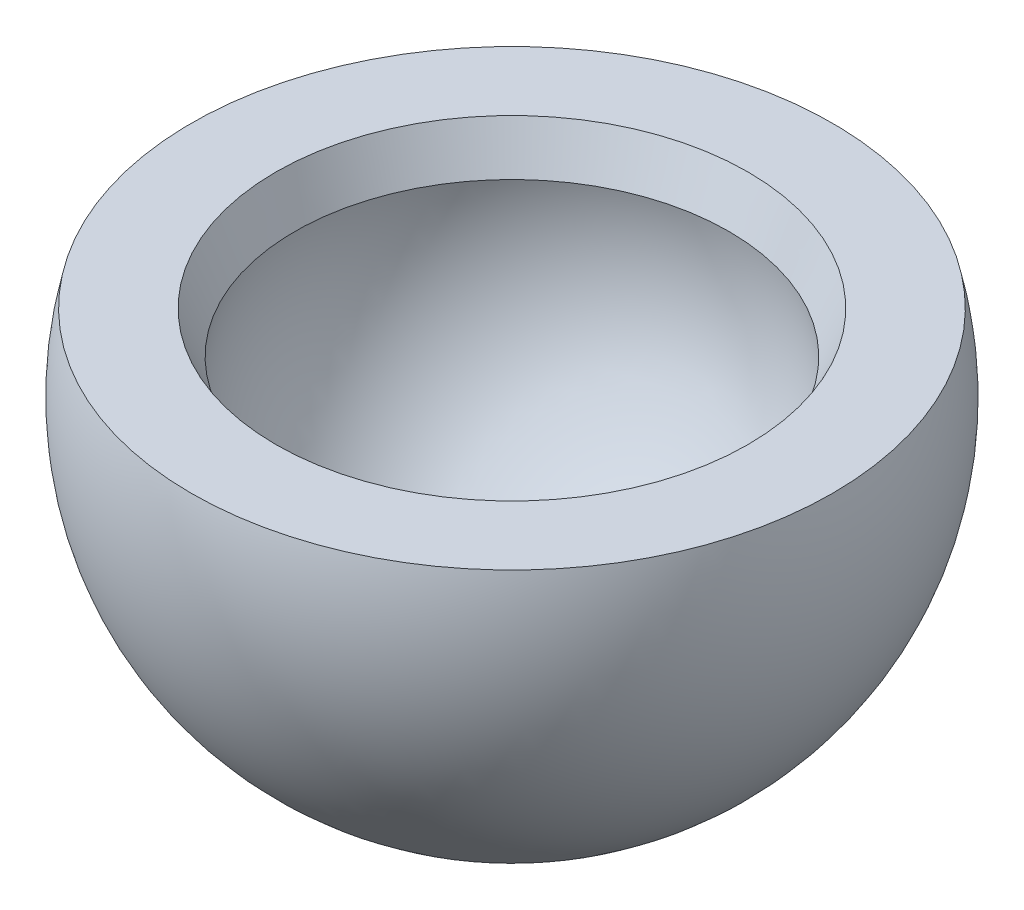
ISO-10303-21;
HEADER;
FILE_DESCRIPTION(('STEP AP214'),'2;1');
FILE_NAME('part.step','',(''),(''),'','','');
FILE_SCHEMA(('AUTOMOTIVE_DESIGN { 1 0 10303 214 1 1 1 1 }'));
ENDSEC;
DATA;
#1=APPLICATION_CONTEXT('core data for automotive mechanical design processes');
#2=APPLICATION_PROTOCOL_DEFINITION('international standard','automotive_design',2000,#1);
#3=PRODUCT_CONTEXT('',#1,'mechanical');
#4=PRODUCT('Part','Part','',(#3));
#5=PRODUCT_RELATED_PRODUCT_CATEGORY('part','',(#4));
#6=PRODUCT_DEFINITION_FORMATION('','',#4);
#7=PRODUCT_DEFINITION_CONTEXT('part definition',#1,'design');
#8=PRODUCT_DEFINITION('design','',#6,#7);
#9=PRODUCT_DEFINITION_SHAPE('','',#8);
#10=(LENGTH_UNIT() NAMED_UNIT(*) SI_UNIT(.MILLI.,.METRE.));
#11=(NAMED_UNIT(*) PLANE_ANGLE_UNIT() SI_UNIT($,.RADIAN.));
#12=(NAMED_UNIT(*) SI_UNIT($,.STERADIAN.) SOLID_ANGLE_UNIT());
#13=UNCERTAINTY_MEASURE_WITH_UNIT(LENGTH_MEASURE(1.E-05),#10,'distance_accuracy_value','');
#14=(GEOMETRIC_REPRESENTATION_CONTEXT(3) GLOBAL_UNCERTAINTY_ASSIGNED_CONTEXT((#13)) GLOBAL_UNIT_ASSIGNED_CONTEXT((#10,
#11,#12)) REPRESENTATION_CONTEXT('',''));
#15=CARTESIAN_POINT('',(0.,0.,0.));
#16=DIRECTION('',(0.,0.,1.));
#17=DIRECTION('',(1.,0.,0.));
#18=AXIS2_PLACEMENT_3D('',#15,#16,#17);
#19=CARTESIAN_POINT('',(0.,8.89,0.));
#20=DIRECTION('',(0.,1.,0.));
#21=DIRECTION('',(0.,0.,1.));
#22=AXIS2_PLACEMENT_3D('',#19,#20,#21);
#23=PLANE('',#22);
#24=CARTESIAN_POINT('',(0.,8.89,0.));
#25=DIRECTION('',(0.,1.,0.));
#26=DIRECTION('',(0.,0.,1.));
#27=AXIS2_PLACEMENT_3D('',#24,#25,#26);
#28=CIRCLE('',#27,27.2829600328787);
#29=CARTESIAN_POINT('',(0.,8.89,27.2829600328787));
#30=VERTEX_POINT('',#29);
#31=EDGE_CURVE('E39',#30,#30,#28,.F.);
#32=ORIENTED_EDGE('',*,*,#31,.T.);
#33=EDGE_LOOP('',(#32));
#34=FACE_BOUND('',#33,.T.);
#35=CARTESIAN_POINT('',(0.,8.89,0.));
#36=DIRECTION('',(0.,1.,0.));
#37=DIRECTION('',(0.,0.,1.));
#38=AXIS2_PLACEMENT_3D('',#35,#36,#37);
#39=CIRCLE('',#38,37.0483184503696);
#40=CARTESIAN_POINT('',(0.,8.89,37.0483184503696));
#41=VERTEX_POINT('',#40);
#42=EDGE_CURVE('E43',#41,#41,#39,.T.);
#43=ORIENTED_EDGE('',*,*,#42,.T.);
#44=EDGE_LOOP('',(#43));
#45=FACE_BOUND('',#44,.T.);
#46=ADVANCED_FACE('F32',(#34,#45),#23,.T.);
#47=CARTESIAN_POINT('',(0.,0.,0.));
#48=DIRECTION('',(0.,1.,0.));
#49=DIRECTION('',(1.,0.,0.));
#50=AXIS2_PLACEMENT_3D('',#47,#48,#49);
#51=SPHERICAL_SURFACE('',#50,38.1);
#52=ORIENTED_EDGE('',*,*,#42,.F.);
#53=EDGE_LOOP('',(#52));
#54=FACE_BOUND('',#53,.T.);
#55=ADVANCED_FACE('F51',(#54),#51,.T.);
#56=CARTESIAN_POINT('',(0.,0.,0.));
#57=DIRECTION('',(0.,0.,-1.));
#58=DIRECTION('',(1.,0.,0.));
#59=AXIS2_PLACEMENT_3D('',#56,#57,#58);
#60=SPHERICAL_SURFACE('',#59,25.4);
#61=CARTESIAN_POINT('',(0.,0.,0.));
#62=DIRECTION('',(0.,-1.,0.));
#63=DIRECTION('',(0.,0.,-1.));
#64=AXIS2_PLACEMENT_3D('',#61,#62,#63);
#65=SPHERICAL_SURFACE('',#64,25.4);
#66=CARTESIAN_POINT('',(0.,4.04852083822839,0.));
#67=DIRECTION('',(0.,-1.,0.));
#68=DIRECTION('',(0.,0.,-1.));
#69=AXIS2_PLACEMENT_3D('',#66,#67,#68);
#70=CIRCLE('',#69,25.0752762501718);
#71=CARTESIAN_POINT('',(0.,4.04852083822839,-25.0752762501718));
#72=VERTEX_POINT('',#71);
#73=EDGE_CURVE('E10',#72,#72,#70,.F.);
#74=ORIENTED_EDGE('',*,*,#73,.T.);
#75=EDGE_LOOP('',(#74));
#76=FACE_BOUND('',#75,.T.);
#77=ADVANCED_FACE('F53',(#76),#65,.F.);
#78=CARTESIAN_POINT('',(0.,8.89,0.));
#79=DIRECTION('',(0.,1.,0.));
#80=DIRECTION('',(0.,0.,1.));
#81=AXIS2_PLACEMENT_3D('',#78,#79,#80);
#82=CONICAL_SURFACE('',#81,27.2829600328787,0.427827059751936);
#83=ORIENTED_EDGE('',*,*,#73,.F.);
#84=EDGE_LOOP('',(#83));
#85=FACE_BOUND('',#84,.T.);
#86=ORIENTED_EDGE('',*,*,#31,.F.);
#87=EDGE_LOOP('',(#86));
#88=FACE_BOUND('',#87,.T.);
#89=ADVANCED_FACE('F34',(#85,#88),#82,.F.);
#90=CLOSED_SHELL('',(#46,#55,#77,#89));
#91=MANIFOLD_SOLID_BREP('B2',#90);
#92=ADVANCED_BREP_SHAPE_REPRESENTATION('',(#18,#91),#14);
#93=SHAPE_DEFINITION_REPRESENTATION(#9,#92);
ENDSEC;
END-ISO-10303-21;
